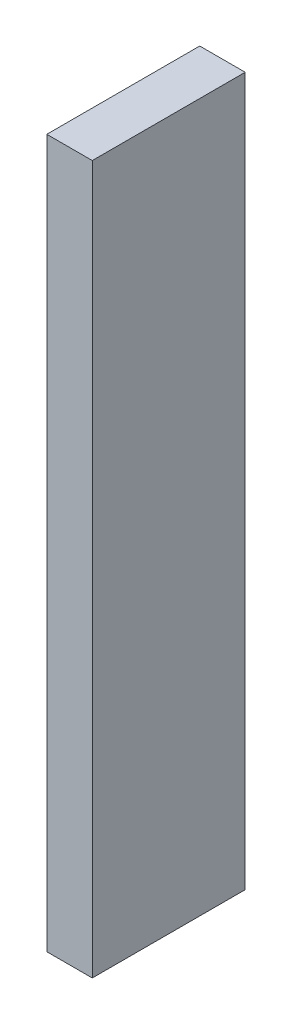
ISO-10303-21;
HEADER;
FILE_DESCRIPTION(('STEP AP214'),'2;1');
FILE_NAME('part.step','',(''),(''),'','','');
FILE_SCHEMA(('AUTOMOTIVE_DESIGN { 1 0 10303 214 1 1 1 1 }'));
ENDSEC;
DATA;
#1=APPLICATION_CONTEXT('core data for automotive mechanical design processes');
#2=APPLICATION_PROTOCOL_DEFINITION('international standard','automotive_design',2000,#1);
#3=PRODUCT_CONTEXT('',#1,'mechanical');
#4=PRODUCT('Part','Part','',(#3));
#5=PRODUCT_RELATED_PRODUCT_CATEGORY('part','',(#4));
#6=PRODUCT_DEFINITION_FORMATION('','',#4);
#7=PRODUCT_DEFINITION_CONTEXT('part definition',#1,'design');
#8=PRODUCT_DEFINITION('design','',#6,#7);
#9=PRODUCT_DEFINITION_SHAPE('','',#8);
#10=(LENGTH_UNIT() NAMED_UNIT(*) SI_UNIT(.MILLI.,.METRE.));
#11=(NAMED_UNIT(*) PLANE_ANGLE_UNIT() SI_UNIT($,.RADIAN.));
#12=(NAMED_UNIT(*) SI_UNIT($,.STERADIAN.) SOLID_ANGLE_UNIT());
#13=UNCERTAINTY_MEASURE_WITH_UNIT(LENGTH_MEASURE(1.E-05),#10,'distance_accuracy_value','');
#14=(GEOMETRIC_REPRESENTATION_CONTEXT(3) GLOBAL_UNCERTAINTY_ASSIGNED_CONTEXT((#13)) GLOBAL_UNIT_ASSIGNED_CONTEXT((#10,
#11,#12)) REPRESENTATION_CONTEXT('',''));
#15=CARTESIAN_POINT('',(0.,0.,0.));
#16=DIRECTION('',(0.,0.,1.));
#17=DIRECTION('',(1.,0.,0.));
#18=AXIS2_PLACEMENT_3D('',#15,#16,#17);
#19=CARTESIAN_POINT('',(130.275545144781,22.4180708263693,126.072024477607));
#20=DIRECTION('',(-1.69244514382854E-09,0.,1.));
#21=DIRECTION('',(1.,0.,1.69244514382854E-09));
#22=AXIS2_PLACEMENT_3D('',#19,#20,#21);
#23=PLANE('',#22);
#24=DIRECTION('',(0.,-1.,0.));
#25=VECTOR('',#24,1.);
#26=CARTESIAN_POINT('',(131.258630241794,22.4180708263693,126.07202447927));
#27=LINE('',#26,#25);
#28=CARTESIAN_POINT('',(131.258630241794,22.4180708263693,126.07202447927));
#29=VERTEX_POINT('',#28);
#30=CARTESIAN_POINT('',(131.258630241794,7.11212965552235,126.07202447927));
#31=VERTEX_POINT('',#30);
#32=EDGE_CURVE('E79',#29,#31,#27,.T.);
#33=ORIENTED_EDGE('',*,*,#32,.F.);
#34=DIRECTION('',(1.,0.,1.69244514382854E-09));
#35=VECTOR('',#34,1.);
#36=CARTESIAN_POINT('',(130.275545144781,22.4180708263693,126.072024477607));
#37=LINE('',#36,#35);
#38=CARTESIAN_POINT('',(130.275545144781,22.4180708263693,126.072024477607));
#39=VERTEX_POINT('',#38);
#40=EDGE_CURVE('E32',#39,#29,#37,.T.);
#41=ORIENTED_EDGE('',*,*,#40,.F.);
#42=DIRECTION('',(0.,-1.,0.));
#43=VECTOR('',#42,1.);
#44=CARTESIAN_POINT('',(130.275545144781,22.4180708263693,126.072024477607));
#45=LINE('',#44,#43);
#46=CARTESIAN_POINT('',(130.275545144781,7.11212965552235,126.072024477607));
#47=VERTEX_POINT('',#46);
#48=EDGE_CURVE('E71',#39,#47,#45,.T.);
#49=ORIENTED_EDGE('',*,*,#48,.T.);
#50=DIRECTION('',(1.,0.,1.69244514382854E-09));
#51=VECTOR('',#50,1.);
#52=CARTESIAN_POINT('',(130.275545144781,7.11212965552235,126.072024477607));
#53=LINE('',#52,#51);
#54=EDGE_CURVE('E10',#47,#31,#53,.T.);
#55=ORIENTED_EDGE('',*,*,#54,.T.);
#56=EDGE_LOOP('',(#33,#41,#49,#55));
#57=FACE_BOUND('',#56,.T.);
#58=ADVANCED_FACE('F16',(#57),#23,.T.);
#59=CARTESIAN_POINT('',(130.275545144781,7.11212965552235,126.072024477607));
#60=DIRECTION('',(0.,-1.,0.));
#61=DIRECTION('',(0.,0.,-1.));
#62=AXIS2_PLACEMENT_3D('',#59,#60,#61);
#63=PLANE('',#62);
#64=DIRECTION('',(1.69244514382854E-09,0.,-1.));
#65=VECTOR('',#64,1.);
#66=CARTESIAN_POINT('',(131.258630241794,7.11212965552235,126.07202447927));
#67=LINE('',#66,#65);
#68=CARTESIAN_POINT('',(131.258630247389,7.11212965552235,122.766083308422));
#69=VERTEX_POINT('',#68);
#70=EDGE_CURVE('E82',#31,#69,#67,.T.);
#71=ORIENTED_EDGE('',*,*,#70,.F.);
#72=ORIENTED_EDGE('',*,*,#54,.F.);
#73=DIRECTION('',(1.69244514382854E-09,0.,-1.));
#74=VECTOR('',#73,1.);
#75=CARTESIAN_POINT('',(130.275545144781,7.11212965552235,126.072024477607));
#76=LINE('',#75,#74);
#77=CARTESIAN_POINT('',(130.275545150376,7.11212965552235,122.766083306758));
#78=VERTEX_POINT('',#77);
#79=EDGE_CURVE('E67',#47,#78,#76,.T.);
#80=ORIENTED_EDGE('',*,*,#79,.T.);
#81=DIRECTION('',(1.,0.,1.69244514382854E-09));
#82=VECTOR('',#81,1.);
#83=CARTESIAN_POINT('',(130.275545150376,7.11212965552235,122.766083306758));
#84=LINE('',#83,#82);
#85=EDGE_CURVE('E24',#78,#69,#84,.T.);
#86=ORIENTED_EDGE('',*,*,#85,.T.);
#87=EDGE_LOOP('',(#71,#72,#80,#86));
#88=FACE_BOUND('',#87,.T.);
#89=ADVANCED_FACE('F68',(#88),#63,.T.);
#90=CARTESIAN_POINT('',(130.275545150376,7.11212965552235,122.766083306758));
#91=DIRECTION('',(1.69244514382854E-09,0.,-1.));
#92=DIRECTION('',(-1.,0.,-1.69244514382854E-09));
#93=AXIS2_PLACEMENT_3D('',#90,#91,#92);
#94=PLANE('',#93);
#95=DIRECTION('',(0.,1.,0.));
#96=VECTOR('',#95,1.);
#97=CARTESIAN_POINT('',(131.258630247389,7.11212965552235,122.766083308422));
#98=LINE('',#97,#96);
#99=CARTESIAN_POINT('',(131.258630247389,22.418070826371,122.766083299961));
#100=VERTEX_POINT('',#99);
#101=EDGE_CURVE('E65',#69,#100,#98,.T.);
#102=ORIENTED_EDGE('',*,*,#101,.F.);
#103=ORIENTED_EDGE('',*,*,#85,.F.);
#104=DIRECTION('',(0.,1.,0.));
#105=VECTOR('',#104,1.);
#106=CARTESIAN_POINT('',(130.275545150376,7.11212965552235,122.766083306758));
#107=LINE('',#106,#105);
#108=CARTESIAN_POINT('',(130.275545150376,22.418070826371,122.766083298297));
#109=VERTEX_POINT('',#108);
#110=EDGE_CURVE('E62',#78,#109,#107,.T.);
#111=ORIENTED_EDGE('',*,*,#110,.T.);
#112=DIRECTION('',(1.,0.,1.69244514382854E-09));
#113=VECTOR('',#112,1.);
#114=CARTESIAN_POINT('',(130.275545150376,22.418070826371,122.766083298297));
#115=LINE('',#114,#113);
#116=EDGE_CURVE('E48',#109,#100,#115,.T.);
#117=ORIENTED_EDGE('',*,*,#116,.T.);
#118=EDGE_LOOP('',(#102,#103,#111,#117));
#119=FACE_BOUND('',#118,.T.);
#120=ADVANCED_FACE('F60',(#119),#94,.T.);
#121=CARTESIAN_POINT('',(130.275545150376,22.418070826371,122.766083298297));
#122=DIRECTION('',(0.,1.,0.));
#123=DIRECTION('',(-1.,0.,0.));
#124=AXIS2_PLACEMENT_3D('',#121,#122,#123);
#125=PLANE('',#124);
#126=DIRECTION('',(-1.69244514382854E-09,0.,1.));
#127=VECTOR('',#126,1.);
#128=CARTESIAN_POINT('',(131.258630247389,22.418070826371,122.766083299961));
#129=LINE('',#128,#127);
#130=EDGE_CURVE('E85',#100,#29,#129,.T.);
#131=ORIENTED_EDGE('',*,*,#130,.F.);
#132=ORIENTED_EDGE('',*,*,#116,.F.);
#133=DIRECTION('',(-1.69244514382854E-09,0.,1.));
#134=VECTOR('',#133,1.);
#135=CARTESIAN_POINT('',(130.275545150376,22.418070826371,122.766083298297));
#136=LINE('',#135,#134);
#137=EDGE_CURVE('E74',#109,#39,#136,.T.);
#138=ORIENTED_EDGE('',*,*,#137,.T.);
#139=ORIENTED_EDGE('',*,*,#40,.T.);
#140=EDGE_LOOP('',(#131,#132,#138,#139));
#141=FACE_BOUND('',#140,.T.);
#142=ADVANCED_FACE('F96',(#141),#125,.T.);
#143=CARTESIAN_POINT('',(130.275545201028,17.2651002409467,92.8378607087388));
#144=DIRECTION('',(1.,0.,1.69244514382854E-09));
#145=DIRECTION('',(0.,1.,0.));
#146=AXIS2_PLACEMENT_3D('',#143,#144,#145);
#147=PLANE('',#146);
#148=ORIENTED_EDGE('',*,*,#48,.F.);
#149=ORIENTED_EDGE('',*,*,#137,.F.);
#150=ORIENTED_EDGE('',*,*,#110,.F.);
#151=ORIENTED_EDGE('',*,*,#79,.F.);
#152=EDGE_LOOP('',(#148,#149,#150,#151));
#153=FACE_BOUND('',#152,.T.);
#154=ADVANCED_FACE('F73',(#153),#147,.F.);
#155=CARTESIAN_POINT('',(131.258630298041,17.2651002409467,92.8378607104026));
#156=DIRECTION('',(1.,0.,1.69244514382854E-09));
#157=DIRECTION('',(0.,1.,0.));
#158=AXIS2_PLACEMENT_3D('',#155,#156,#157);
#159=PLANE('',#158);
#160=ORIENTED_EDGE('',*,*,#32,.T.);
#161=ORIENTED_EDGE('',*,*,#70,.T.);
#162=ORIENTED_EDGE('',*,*,#101,.T.);
#163=ORIENTED_EDGE('',*,*,#130,.T.);
#164=EDGE_LOOP('',(#160,#161,#162,#163));
#165=FACE_BOUND('',#164,.T.);
#166=ADVANCED_FACE('F89',(#165),#159,.T.);
#167=CLOSED_SHELL('',(#58,#89,#120,#142,#154,#166));
#168=MANIFOLD_SOLID_BREP('B1',#167);
#169=ADVANCED_BREP_SHAPE_REPRESENTATION('',(#18,#168),#14);
#170=SHAPE_DEFINITION_REPRESENTATION(#9,#169);
ENDSEC;
END-ISO-10303-21;
